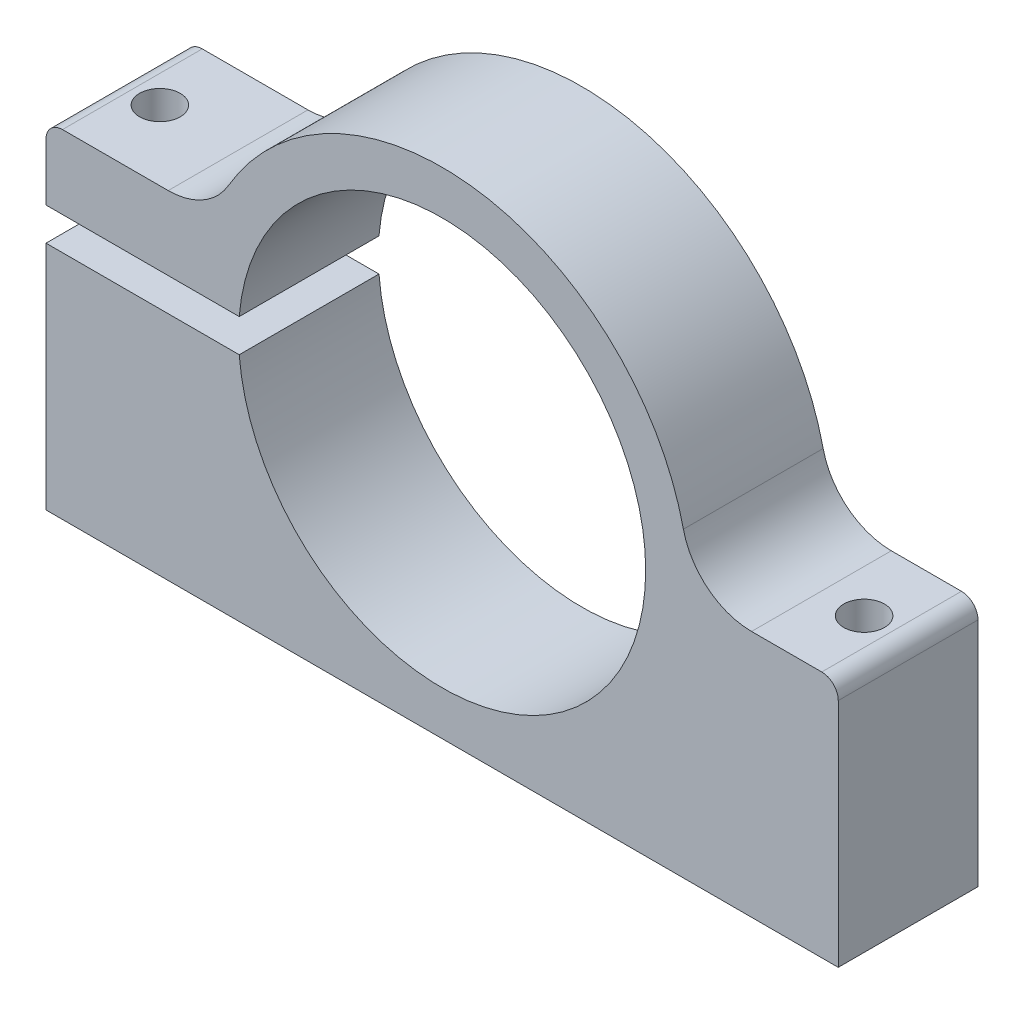
ISO-10303-21;
HEADER;
FILE_DESCRIPTION(('STEP AP214'),'2;1');
FILE_NAME('part.step','',(''),(''),'','','');
FILE_SCHEMA(('AUTOMOTIVE_DESIGN { 1 0 10303 214 1 1 1 1 }'));
ENDSEC;
DATA;
#1=APPLICATION_CONTEXT('core data for automotive mechanical design processes');
#2=APPLICATION_PROTOCOL_DEFINITION('international standard','automotive_design',2000,#1);
#3=PRODUCT_CONTEXT('',#1,'mechanical');
#4=PRODUCT('Part','Part','',(#3));
#5=PRODUCT_RELATED_PRODUCT_CATEGORY('part','',(#4));
#6=PRODUCT_DEFINITION_FORMATION('','',#4);
#7=PRODUCT_DEFINITION_CONTEXT('part definition',#1,'design');
#8=PRODUCT_DEFINITION('design','',#6,#7);
#9=PRODUCT_DEFINITION_SHAPE('','',#8);
#10=(LENGTH_UNIT() NAMED_UNIT(*) SI_UNIT(.MILLI.,.METRE.));
#11=(NAMED_UNIT(*) PLANE_ANGLE_UNIT() SI_UNIT($,.RADIAN.));
#12=(NAMED_UNIT(*) SI_UNIT($,.STERADIAN.) SOLID_ANGLE_UNIT());
#13=UNCERTAINTY_MEASURE_WITH_UNIT(LENGTH_MEASURE(1.E-05),#10,'distance_accuracy_value','');
#14=(GEOMETRIC_REPRESENTATION_CONTEXT(3) GLOBAL_UNCERTAINTY_ASSIGNED_CONTEXT((#13)) GLOBAL_UNIT_ASSIGNED_CONTEXT((#10,
#11,#12)) REPRESENTATION_CONTEXT('',''));
#15=CARTESIAN_POINT('',(0.,0.,0.));
#16=DIRECTION('',(0.,0.,1.));
#17=DIRECTION('',(1.,0.,0.));
#18=AXIS2_PLACEMENT_3D('',#15,#16,#17);
#19=CARTESIAN_POINT('',(-11.2892247421141,1.61408460070721,-12.299495872585));
#20=DIRECTION('',(0.,1.,0.));
#21=DIRECTION('',(-1.,0.,0.));
#22=AXIS2_PLACEMENT_3D('',#19,#20,#21);
#23=PLANE('',#22);
#24=CARTESIAN_POINT('',(-20.8593250544204,1.61408460070721,-5.94949587258498));
#25=DIRECTION('',(0.,1.,0.));
#26=DIRECTION('',(-1.,0.,0.));
#27=AXIS2_PLACEMENT_3D('',#24,#25,#26);
#28=CIRCLE('',#27,1.85);
#29=CARTESIAN_POINT('',(-22.7093250544204,1.61408460070721,-5.94949587258498));
#30=VERTEX_POINT('',#29);
#31=EDGE_CURVE('E137',#30,#30,#28,.T.);
#32=ORIENTED_EDGE('',*,*,#31,.T.);
#33=EDGE_LOOP('',(#32));
#34=FACE_BOUND('',#33,.T.);
#35=DIRECTION('',(-1.,0.,0.));
#36=VECTOR('',#35,1.);
#37=CARTESIAN_POINT('',(-11.2892247421141,1.61408460070721,0.400504127415024));
#38=LINE('',#37,#36);
#39=CARTESIAN_POINT('',(-7.2984139690062,1.61408460070721,0.400504127415024));
#40=VERTEX_POINT('',#39);
#41=CARTESIAN_POINT('',(-24.8593250544204,1.61408460070721,0.400504127415024));
#42=VERTEX_POINT('',#41);
#43=EDGE_CURVE('E126',#40,#42,#38,.T.);
#44=ORIENTED_EDGE('',*,*,#43,.T.);
#45=DIRECTION('',(0.,0.,1.));
#46=VECTOR('',#45,1.);
#47=CARTESIAN_POINT('',(-24.8593250544204,1.61408460070721,-12.299495872585));
#48=LINE('',#47,#46);
#49=CARTESIAN_POINT('',(-24.8593250544204,1.61408460070721,-12.299495872585));
#50=VERTEX_POINT('',#49);
#51=EDGE_CURVE('E186',#50,#42,#48,.T.);
#52=ORIENTED_EDGE('',*,*,#51,.F.);
#53=DIRECTION('',(-1.,0.,0.));
#54=VECTOR('',#53,1.);
#55=CARTESIAN_POINT('',(-11.2892247421141,1.61408460070721,-12.299495872585));
#56=LINE('',#55,#54);
#57=CARTESIAN_POINT('',(-7.2984139690062,1.61408460070722,-12.299495872585));
#58=VERTEX_POINT('',#57);
#59=EDGE_CURVE('E165',#58,#50,#56,.T.);
#60=ORIENTED_EDGE('',*,*,#59,.F.);
#61=DIRECTION('',(0.,0.,1.));
#62=VECTOR('',#61,1.);
#63=CARTESIAN_POINT('',(-7.2984139690062,1.61408460070721,-12.299495872585));
#64=LINE('',#63,#62);
#65=EDGE_CURVE('E136',#58,#40,#64,.T.);
#66=ORIENTED_EDGE('',*,*,#65,.T.);
#67=EDGE_LOOP('',(#44,#52,#60,#66));
#68=FACE_BOUND('',#67,.T.);
#69=ADVANCED_FACE('F15',(#34,#68),#23,.F.);
#70=CARTESIAN_POINT('',(-24.8593250544204,1.61408460070721,-12.299495872585));
#71=DIRECTION('',(1.,0.,0.));
#72=DIRECTION('',(0.,0.,-1.));
#73=AXIS2_PLACEMENT_3D('',#70,#71,#72);
#74=PLANE('',#73);
#75=DIRECTION('',(0.,1.,0.));
#76=VECTOR('',#75,1.);
#77=CARTESIAN_POINT('',(-24.8593250544204,1.61408460070721,0.400504127415024));
#78=LINE('',#77,#76);
#79=CARTESIAN_POINT('',(-24.8593250544204,6.80510216704339,0.400504127415024));
#80=VERTEX_POINT('',#79);
#81=EDGE_CURVE('E183',#42,#80,#78,.T.);
#82=ORIENTED_EDGE('',*,*,#81,.T.);
#83=DIRECTION('',(0.,0.,1.));
#84=VECTOR('',#83,1.);
#85=CARTESIAN_POINT('',(-24.8593250544204,6.80510216704339,-12.299495872585));
#86=LINE('',#85,#84);
#87=CARTESIAN_POINT('',(-24.8593250544204,6.80510216704339,-12.299495872585));
#88=VERTEX_POINT('',#87);
#89=EDGE_CURVE('E23',#80,#88,#86,.F.);
#90=ORIENTED_EDGE('',*,*,#89,.T.);
#91=DIRECTION('',(0.,1.,0.));
#92=VECTOR('',#91,1.);
#93=CARTESIAN_POINT('',(-24.8593250544204,1.61408460070721,-12.299495872585));
#94=LINE('',#93,#92);
#95=EDGE_CURVE('E163',#50,#88,#94,.T.);
#96=ORIENTED_EDGE('',*,*,#95,.F.);
#97=ORIENTED_EDGE('',*,*,#51,.T.);
#98=EDGE_LOOP('',(#82,#90,#96,#97));
#99=FACE_BOUND('',#98,.T.);
#100=ADVANCED_FACE('F308',(#99),#74,.F.);
#101=CARTESIAN_POINT('',(-24.8593250544204,8.30510216704339,-12.299495872585));
#102=DIRECTION('',(0.,-1.,0.));
#103=DIRECTION('',(1.,0.,0.));
#104=AXIS2_PLACEMENT_3D('',#101,#102,#103);
#105=PLANE('',#104);
#106=CARTESIAN_POINT('',(-20.8593250544204,8.30510216704339,-5.94949587258498));
#107=DIRECTION('',(0.,1.,0.));
#108=DIRECTION('',(-1.,0.,0.));
#109=AXIS2_PLACEMENT_3D('',#106,#107,#108);
#110=CIRCLE('',#109,1.85);
#111=CARTESIAN_POINT('',(-22.7093250544204,8.30510216704339,-5.94949587258498));
#112=VERTEX_POINT('',#111);
#113=EDGE_CURVE('E276',#112,#112,#110,.T.);
#114=ORIENTED_EDGE('',*,*,#113,.F.);
#115=EDGE_LOOP('',(#114));
#116=FACE_BOUND('',#115,.T.);
#117=DIRECTION('',(1.,0.,0.));
#118=VECTOR('',#117,1.);
#119=CARTESIAN_POINT('',(-24.8593250544204,8.30510216704339,-12.299495872585));
#120=LINE('',#119,#118);
#121=CARTESIAN_POINT('',(-23.3593250544204,8.30510216704339,-12.299495872585));
#122=VERTEX_POINT('',#121);
#123=CARTESIAN_POINT('',(-13.7536558977169,8.30510216704339,-12.299495872585));
#124=VERTEX_POINT('',#123);
#125=EDGE_CURVE('E161',#122,#124,#120,.T.);
#126=ORIENTED_EDGE('',*,*,#125,.F.);
#127=DIRECTION('',(0.,0.,1.));
#128=VECTOR('',#127,1.);
#129=CARTESIAN_POINT('',(-23.3593250544204,8.30510216704339,-12.299495872585));
#130=LINE('',#129,#128);
#131=CARTESIAN_POINT('',(-23.3593250544204,8.30510216704339,0.400504127415024));
#132=VERTEX_POINT('',#131);
#133=EDGE_CURVE('E228',#122,#132,#130,.T.);
#134=ORIENTED_EDGE('',*,*,#133,.T.);
#135=DIRECTION('',(1.,0.,0.));
#136=VECTOR('',#135,1.);
#137=CARTESIAN_POINT('',(-24.8593250544204,8.30510216704339,0.400504127415024));
#138=LINE('',#137,#136);
#139=CARTESIAN_POINT('',(-13.7536558977169,8.30510216704339,0.400504127415024));
#140=VERTEX_POINT('',#139);
#141=EDGE_CURVE('E181',#132,#140,#138,.T.);
#142=ORIENTED_EDGE('',*,*,#141,.T.);
#143=DIRECTION('',(0.,0.,1.));
#144=VECTOR('',#143,1.);
#145=CARTESIAN_POINT('',(-13.7536558977169,8.30510216704339,-12.299495872585));
#146=LINE('',#145,#144);
#147=EDGE_CURVE('E211',#140,#124,#146,.F.);
#148=ORIENTED_EDGE('',*,*,#147,.T.);
#149=EDGE_LOOP('',(#126,#134,#142,#148));
#150=FACE_BOUND('',#149,.T.);
#151=ADVANCED_FACE('F234',(#116,#150),#105,.F.);
#152=CARTESIAN_POINT('',(11.1406749455796,0.114084600707214,-12.299495872585));
#153=DIRECTION('',(0.,0.,1.));
#154=DIRECTION('',(1.,0.,0.));
#155=AXIS2_PLACEMENT_3D('',#152,#153,#154);
#156=CYLINDRICAL_SURFACE('',#155,22.48);
#157=CARTESIAN_POINT('',(11.1406749455796,0.114084600707214,-12.299495872585));
#158=DIRECTION('',(0.,0.,1.));
#159=DIRECTION('',(1.,0.,0.));
#160=AXIS2_PLACEMENT_3D('',#157,#158,#159);
#161=CIRCLE('',#160,22.48);
#162=CARTESIAN_POINT('',(33.068609962972,5.06545470129688,-12.299495872585));
#163=VERTEX_POINT('',#162);
#164=CARTESIAN_POINT('',(-8.27051330822913,11.4523459566294,-12.299495872585));
#165=VERTEX_POINT('',#164);
#166=EDGE_CURVE('E158',#163,#165,#161,.T.);
#167=ORIENTED_EDGE('',*,*,#166,.T.);
#168=DIRECTION('',(0.,0.,1.));
#169=VECTOR('',#168,1.);
#170=CARTESIAN_POINT('',(-8.27051330822913,11.4523459566294,-12.299495872585));
#171=LINE('',#170,#169);
#172=CARTESIAN_POINT('',(-8.27051330822913,11.4523459566294,0.400504127415024));
#173=VERTEX_POINT('',#172);
#174=EDGE_CURVE('E208',#165,#173,#171,.T.);
#175=ORIENTED_EDGE('',*,*,#174,.T.);
#176=CARTESIAN_POINT('',(11.1406749455796,0.114084600707214,0.400504127415024));
#177=DIRECTION('',(0.,0.,1.));
#178=DIRECTION('',(1.,0.,0.));
#179=AXIS2_PLACEMENT_3D('',#176,#177,#178);
#180=CIRCLE('',#179,22.48);
#181=CARTESIAN_POINT('',(33.068609962972,5.06545470129688,0.400504127415024));
#182=VERTEX_POINT('',#181);
#183=EDGE_CURVE('E178',#182,#173,#180,.T.);
#184=ORIENTED_EDGE('',*,*,#183,.F.);
#185=DIRECTION('',(0.,0.,1.));
#186=VECTOR('',#185,1.);
#187=CARTESIAN_POINT('',(33.068609962972,5.06545470129688,-12.299495872585));
#188=LINE('',#187,#186);
#189=EDGE_CURVE('E201',#182,#163,#188,.F.);
#190=ORIENTED_EDGE('',*,*,#189,.T.);
#191=EDGE_LOOP('',(#167,#175,#184,#190));
#192=FACE_BOUND('',#191,.T.);
#193=ADVANCED_FACE('F247',(#192),#156,.T.);
#194=CARTESIAN_POINT('',(47.1406749455796,0.114084600707214,-12.299495872585));
#195=DIRECTION('',(0.,1.,0.));
#196=DIRECTION('',(-1.,0.,0.));
#197=AXIS2_PLACEMENT_3D('',#194,#195,#196);
#198=PLANE('',#197);
#199=CARTESIAN_POINT('',(43.1406749455796,0.114084600707214,-5.94949587258498));
#200=DIRECTION('',(0.,1.,0.));
#201=DIRECTION('',(-1.,0.,0.));
#202=AXIS2_PLACEMENT_3D('',#199,#200,#201);
#203=CIRCLE('',#202,1.85);
#204=CARTESIAN_POINT('',(41.2906749455796,0.114084600707214,-5.94949587258498));
#205=VERTEX_POINT('',#204);
#206=EDGE_CURVE('E282',#205,#205,#203,.T.);
#207=ORIENTED_EDGE('',*,*,#206,.F.);
#208=EDGE_LOOP('',(#207));
#209=FACE_BOUND('',#208,.T.);
#210=DIRECTION('',(-1.,0.,0.));
#211=VECTOR('',#210,1.);
#212=CARTESIAN_POINT('',(47.1406749455796,0.114084600707214,0.400504127415024));
#213=LINE('',#212,#211);
#214=CARTESIAN_POINT('',(45.6406749455796,0.114084600707214,0.400504127415024));
#215=VERTEX_POINT('',#214);
#216=CARTESIAN_POINT('',(39.2626663402159,0.114084600707214,0.400504127415024));
#217=VERTEX_POINT('',#216);
#218=EDGE_CURVE('E176',#215,#217,#213,.T.);
#219=ORIENTED_EDGE('',*,*,#218,.F.);
#220=DIRECTION('',(0.,0.,1.));
#221=VECTOR('',#220,1.);
#222=CARTESIAN_POINT('',(45.6406749455796,0.114084600707214,-12.299495872585));
#223=LINE('',#222,#221);
#224=CARTESIAN_POINT('',(45.6406749455796,0.114084600707214,-12.299495872585));
#225=VERTEX_POINT('',#224);
#226=EDGE_CURVE('E224',#215,#225,#223,.F.);
#227=ORIENTED_EDGE('',*,*,#226,.T.);
#228=DIRECTION('',(-1.,0.,0.));
#229=VECTOR('',#228,1.);
#230=CARTESIAN_POINT('',(47.1406749455796,0.114084600707214,-12.299495872585));
#231=LINE('',#230,#229);
#232=CARTESIAN_POINT('',(39.2626663402159,0.114084600707214,-12.299495872585));
#233=VERTEX_POINT('',#232);
#234=EDGE_CURVE('E156',#225,#233,#231,.T.);
#235=ORIENTED_EDGE('',*,*,#234,.T.);
#236=DIRECTION('',(0.,0.,-1.));
#237=VECTOR('',#236,1.);
#238=CARTESIAN_POINT('',(39.2626663402159,0.114084600707214,0.400504127415024));
#239=LINE('',#238,#237);
#240=EDGE_CURVE('E189',#233,#217,#239,.F.);
#241=ORIENTED_EDGE('',*,*,#240,.T.);
#242=EDGE_LOOP('',(#219,#227,#235,#241));
#243=FACE_BOUND('',#242,.T.);
#244=ADVANCED_FACE('F297',(#209,#243),#198,.T.);
#245=CARTESIAN_POINT('',(47.1406749455796,-22.3859153992928,-12.299495872585));
#246=DIRECTION('',(1.,0.,0.));
#247=DIRECTION('',(0.,1.,0.));
#248=AXIS2_PLACEMENT_3D('',#245,#246,#247);
#249=PLANE('',#248);
#250=DIRECTION('',(0.,1.,0.));
#251=VECTOR('',#250,1.);
#252=CARTESIAN_POINT('',(47.1406749455796,-22.3859153992928,-12.299495872585));
#253=LINE('',#252,#251);
#254=CARTESIAN_POINT('',(47.1406749455796,-22.3859153992928,-12.299495872585));
#255=VERTEX_POINT('',#254);
#256=CARTESIAN_POINT('',(47.1406749455796,-1.38591539929279,-12.299495872585));
#257=VERTEX_POINT('',#256);
#258=EDGE_CURVE('E153',#255,#257,#253,.T.);
#259=ORIENTED_EDGE('',*,*,#258,.T.);
#260=DIRECTION('',(0.,0.,1.));
#261=VECTOR('',#260,1.);
#262=CARTESIAN_POINT('',(47.1406749455796,-1.38591539929279,-12.299495872585));
#263=LINE('',#262,#261);
#264=CARTESIAN_POINT('',(47.1406749455796,-1.38591539929279,0.400504127415024));
#265=VERTEX_POINT('',#264);
#266=EDGE_CURVE('E219',#257,#265,#263,.T.);
#267=ORIENTED_EDGE('',*,*,#266,.T.);
#268=DIRECTION('',(0.,1.,0.));
#269=VECTOR('',#268,1.);
#270=CARTESIAN_POINT('',(47.1406749455796,-22.3859153992928,0.400504127415024));
#271=LINE('',#270,#269);
#272=CARTESIAN_POINT('',(47.1406749455796,-22.3859153992928,0.400504127415024));
#273=VERTEX_POINT('',#272);
#274=EDGE_CURVE('E173',#273,#265,#271,.T.);
#275=ORIENTED_EDGE('',*,*,#274,.F.);
#276=DIRECTION('',(0.,0.,1.));
#277=VECTOR('',#276,1.);
#278=CARTESIAN_POINT('',(47.1406749455796,-22.3859153992928,-12.299495872585));
#279=LINE('',#278,#277);
#280=EDGE_CURVE('E190',#255,#273,#279,.T.);
#281=ORIENTED_EDGE('',*,*,#280,.F.);
#282=EDGE_LOOP('',(#259,#267,#275,#281));
#283=FACE_BOUND('',#282,.T.);
#284=ADVANCED_FACE('F263',(#283),#249,.T.);
#285=CARTESIAN_POINT('',(-24.8593250544204,-22.3859153992928,-12.299495872585));
#286=DIRECTION('',(0.,-1.,0.));
#287=DIRECTION('',(0.,0.,-1.));
#288=AXIS2_PLACEMENT_3D('',#285,#286,#287);
#289=PLANE('',#288);
#290=CARTESIAN_POINT('',(43.1406749455796,-22.3859153992928,-5.94949587258498));
#291=DIRECTION('',(0.,1.,0.));
#292=DIRECTION('',(-1.,0.,0.));
#293=AXIS2_PLACEMENT_3D('',#290,#291,#292);
#294=CIRCLE('',#293,1.85);
#295=CARTESIAN_POINT('',(41.2906749455796,-22.3859153992928,-5.94949587258498));
#296=VERTEX_POINT('',#295);
#297=EDGE_CURVE('E279',#296,#296,#294,.T.);
#298=ORIENTED_EDGE('',*,*,#297,.T.);
#299=EDGE_LOOP('',(#298));
#300=FACE_BOUND('',#299,.T.);
#301=CARTESIAN_POINT('',(-20.8593250544204,-22.3859153992928,-5.94949587258498));
#302=DIRECTION('',(0.,1.,0.));
#303=DIRECTION('',(-1.,0.,0.));
#304=AXIS2_PLACEMENT_3D('',#301,#302,#303);
#305=CIRCLE('',#304,1.85);
#306=CARTESIAN_POINT('',(-22.7093250544204,-22.3859153992928,-5.94949587258498));
#307=VERTEX_POINT('',#306);
#308=EDGE_CURVE('E198',#307,#307,#305,.T.);
#309=ORIENTED_EDGE('',*,*,#308,.T.);
#310=EDGE_LOOP('',(#309));
#311=FACE_BOUND('',#310,.T.);
#312=DIRECTION('',(1.,0.,0.));
#313=VECTOR('',#312,1.);
#314=CARTESIAN_POINT('',(-24.8593250544204,-22.3859153992928,0.400504127415024));
#315=LINE('',#314,#313);
#316=CARTESIAN_POINT('',(-24.8593250544204,-22.3859153992928,0.400504127415024));
#317=VERTEX_POINT('',#316);
#318=EDGE_CURVE('E170',#317,#273,#315,.T.);
#319=ORIENTED_EDGE('',*,*,#318,.F.);
#320=DIRECTION('',(0.,0.,1.));
#321=VECTOR('',#320,1.);
#322=CARTESIAN_POINT('',(-24.8593250544204,-22.3859153992928,-12.299495872585));
#323=LINE('',#322,#321);
#324=CARTESIAN_POINT('',(-24.8593250544204,-22.3859153992928,-12.299495872585));
#325=VERTEX_POINT('',#324);
#326=EDGE_CURVE('E192',#325,#317,#323,.T.);
#327=ORIENTED_EDGE('',*,*,#326,.F.);
#328=DIRECTION('',(1.,0.,0.));
#329=VECTOR('',#328,1.);
#330=CARTESIAN_POINT('',(-24.8593250544204,-22.3859153992928,-12.299495872585));
#331=LINE('',#330,#329);
#332=EDGE_CURVE('E150',#325,#255,#331,.T.);
#333=ORIENTED_EDGE('',*,*,#332,.T.);
#334=ORIENTED_EDGE('',*,*,#280,.T.);
#335=EDGE_LOOP('',(#319,#327,#333,#334));
#336=FACE_BOUND('',#335,.T.);
#337=ADVANCED_FACE('F268',(#300,#311,#336),#289,.T.);
#338=CARTESIAN_POINT('',(-24.8593250544204,-1.38591539929279,-12.299495872585));
#339=DIRECTION('',(-1.,0.,0.));
#340=DIRECTION('',(0.,-1.,0.));
#341=AXIS2_PLACEMENT_3D('',#338,#339,#340);
#342=PLANE('',#341);
#343=DIRECTION('',(0.,-1.,0.));
#344=VECTOR('',#343,1.);
#345=CARTESIAN_POINT('',(-24.8593250544204,-1.38591539929279,0.400504127415024));
#346=LINE('',#345,#344);
#347=CARTESIAN_POINT('',(-24.8593250544204,-1.38591539929279,0.400504127415024));
#348=VERTEX_POINT('',#347);
#349=EDGE_CURVE('E144',#348,#317,#346,.T.);
#350=ORIENTED_EDGE('',*,*,#349,.F.);
#351=DIRECTION('',(0.,0.,1.));
#352=VECTOR('',#351,1.);
#353=CARTESIAN_POINT('',(-24.8593250544204,-1.38591539929279,-12.299495872585));
#354=LINE('',#353,#352);
#355=CARTESIAN_POINT('',(-24.8593250544204,-1.38591539929279,-12.299495872585));
#356=VERTEX_POINT('',#355);
#357=EDGE_CURVE('E166',#356,#348,#354,.T.);
#358=ORIENTED_EDGE('',*,*,#357,.F.);
#359=DIRECTION('',(0.,-1.,0.));
#360=VECTOR('',#359,1.);
#361=CARTESIAN_POINT('',(-24.8593250544204,-1.38591539929279,-12.299495872585));
#362=LINE('',#361,#360);
#363=EDGE_CURVE('E124',#356,#325,#362,.T.);
#364=ORIENTED_EDGE('',*,*,#363,.T.);
#365=ORIENTED_EDGE('',*,*,#326,.T.);
#366=EDGE_LOOP('',(#350,#358,#364,#365));
#367=FACE_BOUND('',#366,.T.);
#368=ADVANCED_FACE('F270',(#367),#342,.T.);
#369=CARTESIAN_POINT('',(-11.2892247421141,-1.38591539929279,-12.299495872585));
#370=DIRECTION('',(0.,1.,0.));
#371=DIRECTION('',(-1.,0.,0.));
#372=AXIS2_PLACEMENT_3D('',#369,#370,#371);
#373=PLANE('',#372);
#374=CARTESIAN_POINT('',(-20.8593250544204,-1.38591539929279,-5.94949587258498));
#375=DIRECTION('',(0.,1.,0.));
#376=DIRECTION('',(-1.,0.,0.));
#377=AXIS2_PLACEMENT_3D('',#374,#375,#376);
#378=CIRCLE('',#377,1.85);
#379=CARTESIAN_POINT('',(-22.7093250544204,-1.38591539929279,-5.94949587258498));
#380=VERTEX_POINT('',#379);
#381=EDGE_CURVE('E195',#380,#380,#378,.T.);
#382=ORIENTED_EDGE('',*,*,#381,.F.);
#383=EDGE_LOOP('',(#382));
#384=FACE_BOUND('',#383,.T.);
#385=DIRECTION('',(-1.,0.,0.));
#386=VECTOR('',#385,1.);
#387=CARTESIAN_POINT('',(-11.2892247421141,-1.38591539929279,0.400504127415024));
#388=LINE('',#387,#386);
#389=CARTESIAN_POINT('',(-7.29841396900619,-1.38591539929284,0.400504127415024));
#390=VERTEX_POINT('',#389);
#391=EDGE_CURVE('E132',#390,#348,#388,.T.);
#392=ORIENTED_EDGE('',*,*,#391,.F.);
#393=DIRECTION('',(0.,0.,1.));
#394=VECTOR('',#393,1.);
#395=CARTESIAN_POINT('',(-7.29841396900619,-1.38591539929279,-12.299495872585));
#396=LINE('',#395,#394);
#397=CARTESIAN_POINT('',(-7.29841396900619,-1.38591539929279,-12.299495872585));
#398=VERTEX_POINT('',#397);
#399=EDGE_CURVE('E129',#398,#390,#396,.T.);
#400=ORIENTED_EDGE('',*,*,#399,.F.);
#401=DIRECTION('',(-1.,0.,0.));
#402=VECTOR('',#401,1.);
#403=CARTESIAN_POINT('',(-11.2892247421141,-1.38591539929279,-12.299495872585));
#404=LINE('',#403,#402);
#405=EDGE_CURVE('E117',#398,#356,#404,.T.);
#406=ORIENTED_EDGE('',*,*,#405,.T.);
#407=ORIENTED_EDGE('',*,*,#357,.T.);
#408=EDGE_LOOP('',(#392,#400,#406,#407));
#409=FACE_BOUND('',#408,.T.);
#410=ADVANCED_FACE('F130',(#384,#409),#373,.T.);
#411=CARTESIAN_POINT('',(11.1406749455796,0.114084600707214,-12.299495872585));
#412=DIRECTION('',(0.,0.,1.));
#413=DIRECTION('',(1.,0.,0.));
#414=AXIS2_PLACEMENT_3D('',#411,#412,#413);
#415=PLANE('',#414);
#416=ORIENTED_EDGE('',*,*,#95,.T.);
#417=CARTESIAN_POINT('',(-23.3593250544204,6.80510216704339,-12.299495872585));
#418=DIRECTION('',(0.,0.,1.));
#419=DIRECTION('',(1.,0.,0.));
#420=AXIS2_PLACEMENT_3D('',#417,#418,#419);
#421=CIRCLE('',#420,1.5);
#422=EDGE_CURVE('E10',#88,#122,#421,.F.);
#423=ORIENTED_EDGE('',*,*,#422,.T.);
#424=ORIENTED_EDGE('',*,*,#125,.T.);
#425=CARTESIAN_POINT('',(-13.7536558977169,14.6551021670434,-12.299495872585));
#426=DIRECTION('',(0.,0.,1.));
#427=DIRECTION('',(1.,0.,0.));
#428=AXIS2_PLACEMENT_3D('',#425,#426,#427);
#429=CIRCLE('',#428,6.35);
#430=EDGE_CURVE('E217',#124,#165,#429,.T.);
#431=ORIENTED_EDGE('',*,*,#430,.T.);
#432=ORIENTED_EDGE('',*,*,#166,.F.);
#433=CARTESIAN_POINT('',(39.2626663402159,6.46408460070721,-12.299495872585));
#434=DIRECTION('',(0.,0.,1.));
#435=DIRECTION('',(1.,0.,0.));
#436=AXIS2_PLACEMENT_3D('',#433,#434,#435);
#437=CIRCLE('',#436,6.35);
#438=EDGE_CURVE('E205',#163,#233,#437,.T.);
#439=ORIENTED_EDGE('',*,*,#438,.T.);
#440=ORIENTED_EDGE('',*,*,#234,.F.);
#441=CARTESIAN_POINT('',(45.6406749455796,-1.38591539929279,-12.299495872585));
#442=DIRECTION('',(0.,0.,1.));
#443=DIRECTION('',(1.,0.,0.));
#444=AXIS2_PLACEMENT_3D('',#441,#442,#443);
#445=CIRCLE('',#444,1.5);
#446=EDGE_CURVE('E226',#225,#257,#445,.F.);
#447=ORIENTED_EDGE('',*,*,#446,.T.);
#448=ORIENTED_EDGE('',*,*,#258,.F.);
#449=ORIENTED_EDGE('',*,*,#332,.F.);
#450=ORIENTED_EDGE('',*,*,#363,.F.);
#451=ORIENTED_EDGE('',*,*,#405,.F.);
#452=CARTESIAN_POINT('',(11.1406749455796,0.114084600707214,-12.299495872585));
#453=DIRECTION('',(0.,0.,1.));
#454=DIRECTION('',(1.,0.,0.));
#455=AXIS2_PLACEMENT_3D('',#452,#453,#454);
#456=CIRCLE('',#455,18.5);
#457=EDGE_CURVE('E121',#398,#58,#456,.T.);
#458=ORIENTED_EDGE('',*,*,#457,.T.);
#459=ORIENTED_EDGE('',*,*,#59,.T.);
#460=EDGE_LOOP('',(#416,#423,#424,#431,#432,#439,#440,#447,#448,#449,#450,#451,#458,#459));
#461=FACE_BOUND('',#460,.T.);
#462=ADVANCED_FACE('F119',(#461),#415,.F.);
#463=CARTESIAN_POINT('',(11.1406749455796,0.114084600707214,0.400504127415024));
#464=DIRECTION('',(0.,0.,1.));
#465=DIRECTION('',(1.,0.,0.));
#466=AXIS2_PLACEMENT_3D('',#463,#464,#465);
#467=PLANE('',#466);
#468=ORIENTED_EDGE('',*,*,#141,.F.);
#469=CARTESIAN_POINT('',(-23.3593250544204,6.80510216704339,0.400504127415024));
#470=DIRECTION('',(0.,0.,1.));
#471=DIRECTION('',(1.,0.,0.));
#472=AXIS2_PLACEMENT_3D('',#469,#470,#471);
#473=CIRCLE('',#472,1.5);
#474=EDGE_CURVE('E37',#132,#80,#473,.T.);
#475=ORIENTED_EDGE('',*,*,#474,.T.);
#476=ORIENTED_EDGE('',*,*,#81,.F.);
#477=ORIENTED_EDGE('',*,*,#43,.F.);
#478=CARTESIAN_POINT('',(11.1406749455796,0.114084600707214,0.400504127415024));
#479=DIRECTION('',(0.,0.,1.));
#480=DIRECTION('',(1.,0.,0.));
#481=AXIS2_PLACEMENT_3D('',#478,#479,#480);
#482=CIRCLE('',#481,18.5);
#483=EDGE_CURVE('E142',#390,#40,#482,.T.);
#484=ORIENTED_EDGE('',*,*,#483,.F.);
#485=ORIENTED_EDGE('',*,*,#391,.T.);
#486=ORIENTED_EDGE('',*,*,#349,.T.);
#487=ORIENTED_EDGE('',*,*,#318,.T.);
#488=ORIENTED_EDGE('',*,*,#274,.T.);
#489=CARTESIAN_POINT('',(45.6406749455796,-1.38591539929279,0.400504127415024));
#490=DIRECTION('',(0.,0.,1.));
#491=DIRECTION('',(1.,0.,0.));
#492=AXIS2_PLACEMENT_3D('',#489,#490,#491);
#493=CIRCLE('',#492,1.5);
#494=EDGE_CURVE('E222',#265,#215,#493,.T.);
#495=ORIENTED_EDGE('',*,*,#494,.T.);
#496=ORIENTED_EDGE('',*,*,#218,.T.);
#497=CARTESIAN_POINT('',(39.2626663402159,6.46408460070721,0.400504127415024));
#498=DIRECTION('',(0.,0.,1.));
#499=DIRECTION('',(1.,0.,0.));
#500=AXIS2_PLACEMENT_3D('',#497,#498,#499);
#501=CIRCLE('',#500,6.35);
#502=EDGE_CURVE('E203',#217,#182,#501,.F.);
#503=ORIENTED_EDGE('',*,*,#502,.T.);
#504=ORIENTED_EDGE('',*,*,#183,.T.);
#505=CARTESIAN_POINT('',(-13.7536558977169,14.6551021670434,0.400504127415024));
#506=DIRECTION('',(0.,0.,1.));
#507=DIRECTION('',(1.,0.,0.));
#508=AXIS2_PLACEMENT_3D('',#505,#506,#507);
#509=CIRCLE('',#508,6.35);
#510=EDGE_CURVE('E214',#173,#140,#509,.F.);
#511=ORIENTED_EDGE('',*,*,#510,.T.);
#512=EDGE_LOOP('',(#468,#475,#476,#477,#484,#485,#486,#487,#488,#495,#496,#503,#504,#511));
#513=FACE_BOUND('',#512,.T.);
#514=ADVANCED_FACE('F237',(#513),#467,.T.);
#515=CARTESIAN_POINT('',(11.1406749455796,0.114084600707214,-12.299495872585));
#516=DIRECTION('',(0.,0.,1.));
#517=DIRECTION('',(1.,0.,0.));
#518=AXIS2_PLACEMENT_3D('',#515,#516,#517);
#519=CYLINDRICAL_SURFACE('',#518,18.5);
#520=ORIENTED_EDGE('',*,*,#483,.T.);
#521=ORIENTED_EDGE('',*,*,#65,.F.);
#522=ORIENTED_EDGE('',*,*,#457,.F.);
#523=ORIENTED_EDGE('',*,*,#399,.T.);
#524=EDGE_LOOP('',(#520,#521,#522,#523));
#525=FACE_BOUND('',#524,.T.);
#526=ADVANCED_FACE('F140',(#525),#519,.F.);
#527=CARTESIAN_POINT('',(-20.8593250544204,-22.3859153992928,-5.94949587258498));
#528=DIRECTION('',(0.,1.,0.));
#529=DIRECTION('',(-1.,0.,0.));
#530=AXIS2_PLACEMENT_3D('',#527,#528,#529);
#531=CYLINDRICAL_SURFACE('',#530,1.85);
#532=ORIENTED_EDGE('',*,*,#381,.T.);
#533=EDGE_LOOP('',(#532));
#534=FACE_BOUND('',#533,.T.);
#535=ORIENTED_EDGE('',*,*,#308,.F.);
#536=EDGE_LOOP('',(#535));
#537=FACE_BOUND('',#536,.T.);
#538=ADVANCED_FACE('F326',(#534,#537),#531,.F.);
#539=ORIENTED_EDGE('',*,*,#113,.T.);
#540=EDGE_LOOP('',(#539));
#541=FACE_BOUND('',#540,.T.);
#542=ORIENTED_EDGE('',*,*,#31,.F.);
#543=EDGE_LOOP('',(#542));
#544=FACE_BOUND('',#543,.T.);
#545=ADVANCED_FACE('F293',(#541,#544),#531,.F.);
#546=CARTESIAN_POINT('',(43.1406749455796,-22.3859153992928,-5.94949587258498));
#547=DIRECTION('',(0.,1.,0.));
#548=DIRECTION('',(-1.,0.,0.));
#549=AXIS2_PLACEMENT_3D('',#546,#547,#548);
#550=CYLINDRICAL_SURFACE('',#549,1.85);
#551=ORIENTED_EDGE('',*,*,#297,.F.);
#552=EDGE_LOOP('',(#551));
#553=FACE_BOUND('',#552,.T.);
#554=ORIENTED_EDGE('',*,*,#206,.T.);
#555=EDGE_LOOP('',(#554));
#556=FACE_BOUND('',#555,.T.);
#557=ADVANCED_FACE('F290',(#553,#556),#550,.F.);
#558=CARTESIAN_POINT('',(39.2626663402159,6.46408460070721,-12.299495872585));
#559=DIRECTION('',(0.,0.,1.));
#560=DIRECTION('',(1.,0.,0.));
#561=AXIS2_PLACEMENT_3D('',#558,#559,#560);
#562=CYLINDRICAL_SURFACE('',#561,6.35);
#563=ORIENTED_EDGE('',*,*,#438,.F.);
#564=ORIENTED_EDGE('',*,*,#189,.F.);
#565=ORIENTED_EDGE('',*,*,#502,.F.);
#566=ORIENTED_EDGE('',*,*,#240,.F.);
#567=EDGE_LOOP('',(#563,#564,#565,#566));
#568=FACE_BOUND('',#567,.T.);
#569=ADVANCED_FACE('F251',(#568),#562,.F.);
#570=CARTESIAN_POINT('',(-13.7536558977169,14.6551021670434,-12.299495872585));
#571=DIRECTION('',(0.,0.,1.));
#572=DIRECTION('',(1.,0.,0.));
#573=AXIS2_PLACEMENT_3D('',#570,#571,#572);
#574=CYLINDRICAL_SURFACE('',#573,6.35);
#575=ORIENTED_EDGE('',*,*,#430,.F.);
#576=ORIENTED_EDGE('',*,*,#147,.F.);
#577=ORIENTED_EDGE('',*,*,#510,.F.);
#578=ORIENTED_EDGE('',*,*,#174,.F.);
#579=EDGE_LOOP('',(#575,#576,#577,#578));
#580=FACE_BOUND('',#579,.T.);
#581=ADVANCED_FACE('F243',(#580),#574,.F.);
#582=CARTESIAN_POINT('',(45.6406749455796,-1.38591539929279,-12.299495872585));
#583=DIRECTION('',(0.,0.,1.));
#584=DIRECTION('',(1.,0.,0.));
#585=AXIS2_PLACEMENT_3D('',#582,#583,#584);
#586=CYLINDRICAL_SURFACE('',#585,1.5);
#587=ORIENTED_EDGE('',*,*,#446,.F.);
#588=ORIENTED_EDGE('',*,*,#226,.F.);
#589=ORIENTED_EDGE('',*,*,#494,.F.);
#590=ORIENTED_EDGE('',*,*,#266,.F.);
#591=EDGE_LOOP('',(#587,#588,#589,#590));
#592=FACE_BOUND('',#591,.T.);
#593=ADVANCED_FACE('F260',(#592),#586,.T.);
#594=CARTESIAN_POINT('',(-23.3593250544204,6.80510216704339,-12.299495872585));
#595=DIRECTION('',(0.,0.,1.));
#596=DIRECTION('',(1.,0.,0.));
#597=AXIS2_PLACEMENT_3D('',#594,#595,#596);
#598=CYLINDRICAL_SURFACE('',#597,1.5);
#599=ORIENTED_EDGE('',*,*,#422,.F.);
#600=ORIENTED_EDGE('',*,*,#89,.F.);
#601=ORIENTED_EDGE('',*,*,#474,.F.);
#602=ORIENTED_EDGE('',*,*,#133,.F.);
#603=EDGE_LOOP('',(#599,#600,#601,#602));
#604=FACE_BOUND('',#603,.T.);
#605=ADVANCED_FACE('F17',(#604),#598,.T.);
#606=CLOSED_SHELL('',(#69,#100,#151,#193,#244,#284,#337,#368,#410,#462,#514,#526,#538,#545,#557,
#569,#581,#593,#605));
#607=MANIFOLD_SOLID_BREP('B1',#606);
#608=ADVANCED_BREP_SHAPE_REPRESENTATION('',(#18,#607),#14);
#609=SHAPE_DEFINITION_REPRESENTATION(#9,#608);
ENDSEC;
END-ISO-10303-21;
